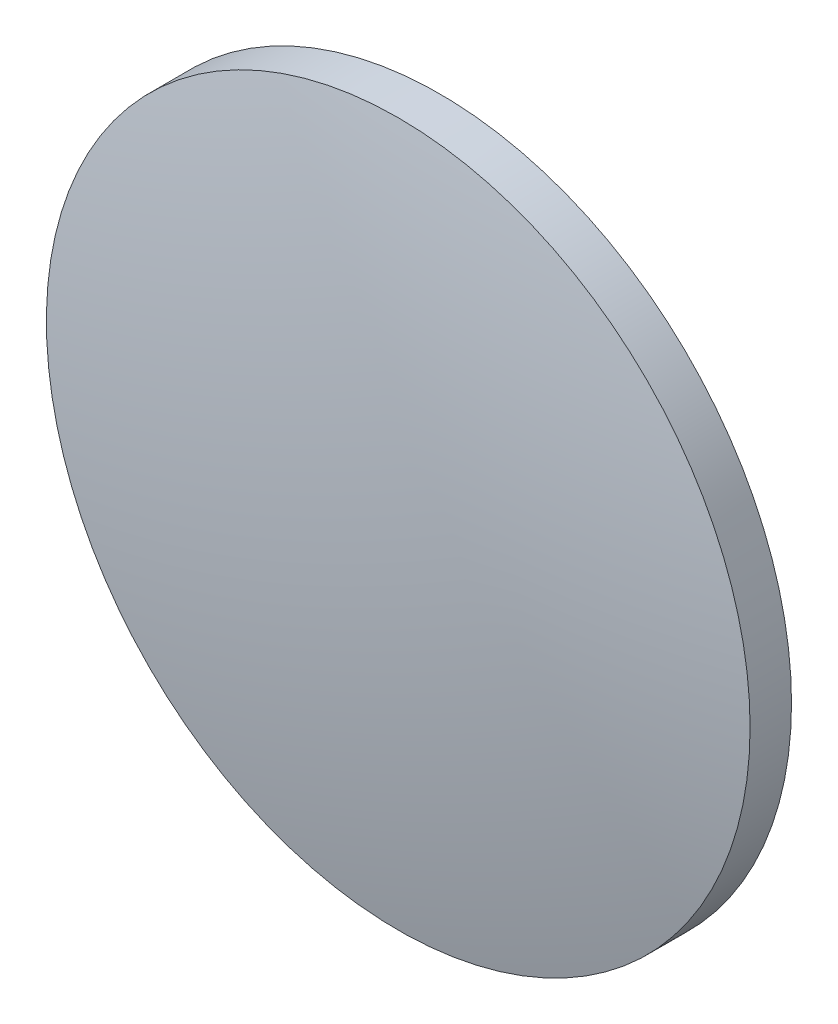
ISO-10303-21;
HEADER;
FILE_DESCRIPTION(('STEP AP214'),'2;1');
FILE_NAME('part.step','',(''),(''),'','','');
FILE_SCHEMA(('AUTOMOTIVE_DESIGN { 1 0 10303 214 1 1 1 1 }'));
ENDSEC;
DATA;
#1=APPLICATION_CONTEXT('core data for automotive mechanical design processes');
#2=APPLICATION_PROTOCOL_DEFINITION('international standard','automotive_design',2000,#1);
#3=PRODUCT_CONTEXT('',#1,'mechanical');
#4=PRODUCT('Part','Part','',(#3));
#5=PRODUCT_RELATED_PRODUCT_CATEGORY('part','',(#4));
#6=PRODUCT_DEFINITION_FORMATION('','',#4);
#7=PRODUCT_DEFINITION_CONTEXT('part definition',#1,'design');
#8=PRODUCT_DEFINITION('design','',#6,#7);
#9=PRODUCT_DEFINITION_SHAPE('','',#8);
#10=(LENGTH_UNIT() NAMED_UNIT(*) SI_UNIT(.MILLI.,.METRE.));
#11=(NAMED_UNIT(*) PLANE_ANGLE_UNIT() SI_UNIT($,.RADIAN.));
#12=(NAMED_UNIT(*) SI_UNIT($,.STERADIAN.) SOLID_ANGLE_UNIT());
#13=UNCERTAINTY_MEASURE_WITH_UNIT(LENGTH_MEASURE(1.E-05),#10,'distance_accuracy_value','');
#14=(GEOMETRIC_REPRESENTATION_CONTEXT(3) GLOBAL_UNCERTAINTY_ASSIGNED_CONTEXT((#13)) GLOBAL_UNIT_ASSIGNED_CONTEXT((#10,
#11,#12)) REPRESENTATION_CONTEXT('',''));
#15=CARTESIAN_POINT('',(0.,0.,0.));
#16=DIRECTION('',(0.,0.,1.));
#17=DIRECTION('',(1.,0.,0.));
#18=AXIS2_PLACEMENT_3D('',#15,#16,#17);
#19=CARTESIAN_POINT('',(0.,0.,-126.01));
#20=DIRECTION('',(0.,0.,1.));
#21=DIRECTION('',(0.,1.,0.));
#22=AXIS2_PLACEMENT_3D('',#19,#20,#21);
#23=SPHERICAL_SURFACE('',#22,128.77);
#24=CARTESIAN_POINT('',(0.,0.,0.230060598844783));
#25=DIRECTION('',(0.,0.,1.));
#26=DIRECTION('',(1.,0.,0.));
#27=AXIS2_PLACEMENT_3D('',#24,#25,#26);
#28=CIRCLE('',#27,25.4);
#29=CARTESIAN_POINT('',(25.4,0.,0.230060598844783));
#30=VERTEX_POINT('',#29);
#31=EDGE_CURVE('E8',#30,#30,#28,.T.);
#32=ORIENTED_EDGE('',*,*,#31,.T.);
#33=EDGE_LOOP('',(#32));
#34=FACE_BOUND('',#33,.T.);
#35=ADVANCED_FACE('F12',(#34),#23,.T.);
#36=CARTESIAN_POINT('',(0.,0.,4.30813204540037));
#37=DIRECTION('',(0.,0.,1.));
#38=DIRECTION('',(1.,0.,0.));
#39=AXIS2_PLACEMENT_3D('',#36,#37,#38);
#40=CYLINDRICAL_SURFACE('',#39,25.4);
#41=ORIENTED_EDGE('',*,*,#31,.F.);
#42=EDGE_LOOP('',(#41));
#43=FACE_BOUND('',#42,.T.);
#44=CARTESIAN_POINT('',(0.,0.,-2.76));
#45=DIRECTION('',(0.,0.,1.));
#46=DIRECTION('',(1.,0.,0.));
#47=AXIS2_PLACEMENT_3D('',#44,#45,#46);
#48=CIRCLE('',#47,25.4);
#49=CARTESIAN_POINT('',(25.4,0.,-2.76));
#50=VERTEX_POINT('',#49);
#51=EDGE_CURVE('E18',#50,#50,#48,.T.);
#52=ORIENTED_EDGE('',*,*,#51,.T.);
#53=EDGE_LOOP('',(#52));
#54=FACE_BOUND('',#53,.T.);
#55=ADVANCED_FACE('F24',(#43,#54),#40,.T.);
#56=CARTESIAN_POINT('',(0.,0.,-2.76));
#57=DIRECTION('',(0.,0.,1.));
#58=DIRECTION('',(1.,0.,0.));
#59=AXIS2_PLACEMENT_3D('',#56,#57,#58);
#60=PLANE('',#59);
#61=ORIENTED_EDGE('',*,*,#51,.F.);
#62=EDGE_LOOP('',(#61));
#63=FACE_BOUND('',#62,.T.);
#64=ADVANCED_FACE('F26',(#63),#60,.F.);
#65=CLOSED_SHELL('',(#35,#55,#64));
#66=MANIFOLD_SOLID_BREP('B1',#65);
#67=ADVANCED_BREP_SHAPE_REPRESENTATION('',(#18,#66),#14);
#68=SHAPE_DEFINITION_REPRESENTATION(#9,#67);
ENDSEC;
END-ISO-10303-21;
